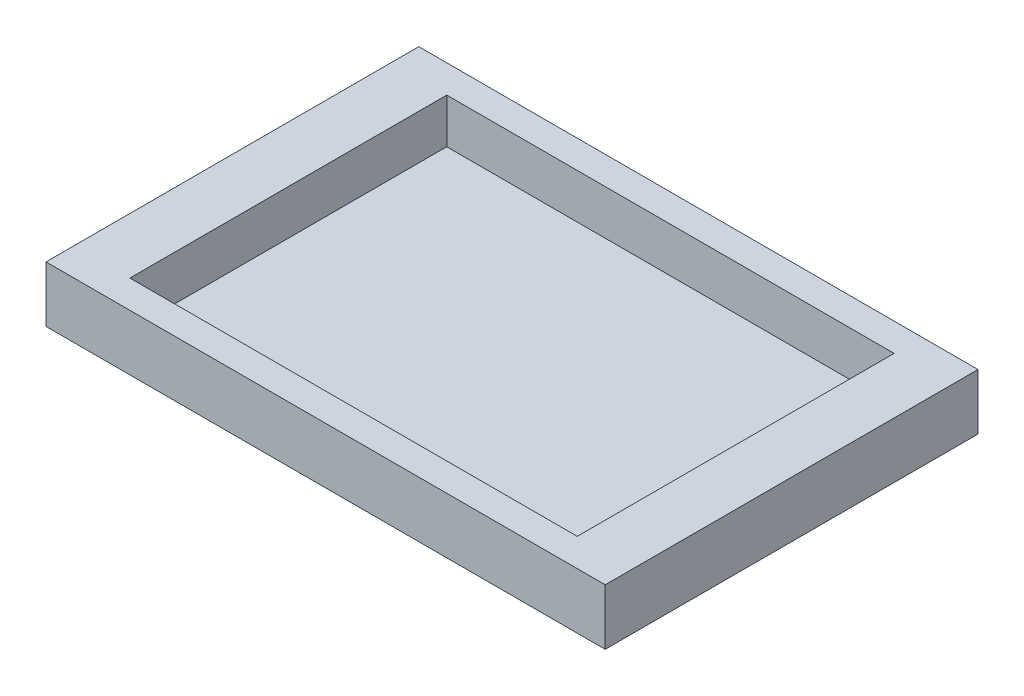
ISO-10303-21;
HEADER;
FILE_DESCRIPTION(('STEP AP214'),'2;1');
FILE_NAME('part.step','',(''),(''),'','','');
FILE_SCHEMA(('AUTOMOTIVE_DESIGN { 1 0 10303 214 1 1 1 1 }'));
ENDSEC;
DATA;
#1=APPLICATION_CONTEXT('core data for automotive mechanical design processes');
#2=APPLICATION_PROTOCOL_DEFINITION('international standard','automotive_design',2000,#1);
#3=PRODUCT_CONTEXT('',#1,'mechanical');
#4=PRODUCT('Part','Part','',(#3));
#5=PRODUCT_RELATED_PRODUCT_CATEGORY('part','',(#4));
#6=PRODUCT_DEFINITION_FORMATION('','',#4);
#7=PRODUCT_DEFINITION_CONTEXT('part definition',#1,'design');
#8=PRODUCT_DEFINITION('design','',#6,#7);
#9=PRODUCT_DEFINITION_SHAPE('','',#8);
#10=(LENGTH_UNIT() NAMED_UNIT(*) SI_UNIT(.MILLI.,.METRE.));
#11=(NAMED_UNIT(*) PLANE_ANGLE_UNIT() SI_UNIT($,.RADIAN.));
#12=(NAMED_UNIT(*) SI_UNIT($,.STERADIAN.) SOLID_ANGLE_UNIT());
#13=UNCERTAINTY_MEASURE_WITH_UNIT(LENGTH_MEASURE(1.E-05),#10,'distance_accuracy_value','');
#14=(GEOMETRIC_REPRESENTATION_CONTEXT(3) GLOBAL_UNCERTAINTY_ASSIGNED_CONTEXT((#13)) GLOBAL_UNIT_ASSIGNED_CONTEXT((#10,
#11,#12)) REPRESENTATION_CONTEXT('',''));
#15=CARTESIAN_POINT('',(0.,0.,0.));
#16=DIRECTION('',(0.,0.,1.));
#17=DIRECTION('',(1.,0.,0.));
#18=AXIS2_PLACEMENT_3D('',#15,#16,#17);
#19=CARTESIAN_POINT('',(75.,15.,-50.));
#20=DIRECTION('',(-1.,0.,0.));
#21=DIRECTION('',(0.,0.,1.));
#22=AXIS2_PLACEMENT_3D('',#19,#20,#21);
#23=PLANE('',#22);
#24=DIRECTION('',(0.,0.,-1.));
#25=VECTOR('',#24,1.);
#26=CARTESIAN_POINT('',(75.,0.,-50.));
#27=LINE('',#26,#25);
#28=CARTESIAN_POINT('',(75.,0.,50.));
#29=VERTEX_POINT('',#28);
#30=CARTESIAN_POINT('',(75.,0.,-50.));
#31=VERTEX_POINT('',#30);
#32=EDGE_CURVE('E143',#29,#31,#27,.T.);
#33=ORIENTED_EDGE('',*,*,#32,.T.);
#34=DIRECTION('',(0.,-1.,0.));
#35=VECTOR('',#34,1.);
#36=CARTESIAN_POINT('',(75.,15.,-50.));
#37=LINE('',#36,#35);
#38=CARTESIAN_POINT('',(75.,15.,-50.));
#39=VERTEX_POINT('',#38);
#40=EDGE_CURVE('E11',#39,#31,#37,.T.);
#41=ORIENTED_EDGE('',*,*,#40,.F.);
#42=DIRECTION('',(0.,0.,-1.));
#43=VECTOR('',#42,1.);
#44=CARTESIAN_POINT('',(75.,15.,-50.));
#45=LINE('',#44,#43);
#46=CARTESIAN_POINT('',(75.,15.,50.));
#47=VERTEX_POINT('',#46);
#48=EDGE_CURVE('E147',#47,#39,#45,.T.);
#49=ORIENTED_EDGE('',*,*,#48,.F.);
#50=DIRECTION('',(0.,-1.,0.));
#51=VECTOR('',#50,1.);
#52=CARTESIAN_POINT('',(75.,15.,50.));
#53=LINE('',#52,#51);
#54=EDGE_CURVE('E153',#47,#29,#53,.T.);
#55=ORIENTED_EDGE('',*,*,#54,.T.);
#56=EDGE_LOOP('',(#33,#41,#49,#55));
#57=FACE_BOUND('',#56,.T.);
#58=ADVANCED_FACE('F35',(#57),#23,.F.);
#59=CARTESIAN_POINT('',(-75.,15.,-50.));
#60=DIRECTION('',(0.,0.,1.));
#61=DIRECTION('',(1.,0.,0.));
#62=AXIS2_PLACEMENT_3D('',#59,#60,#61);
#63=PLANE('',#62);
#64=DIRECTION('',(-1.,0.,0.));
#65=VECTOR('',#64,1.);
#66=CARTESIAN_POINT('',(-75.,0.,-50.));
#67=LINE('',#66,#65);
#68=CARTESIAN_POINT('',(-75.,0.,-50.));
#69=VERTEX_POINT('',#68);
#70=EDGE_CURVE('E156',#31,#69,#67,.T.);
#71=ORIENTED_EDGE('',*,*,#70,.T.);
#72=DIRECTION('',(0.,-1.,0.));
#73=VECTOR('',#72,1.);
#74=CARTESIAN_POINT('',(-75.,15.,-50.));
#75=LINE('',#74,#73);
#76=CARTESIAN_POINT('',(-75.,15.,-50.));
#77=VERTEX_POINT('',#76);
#78=EDGE_CURVE('E42',#77,#69,#75,.T.);
#79=ORIENTED_EDGE('',*,*,#78,.F.);
#80=DIRECTION('',(-1.,0.,0.));
#81=VECTOR('',#80,1.);
#82=CARTESIAN_POINT('',(-75.,15.,-50.));
#83=LINE('',#82,#81);
#84=EDGE_CURVE('E86',#39,#77,#83,.T.);
#85=ORIENTED_EDGE('',*,*,#84,.F.);
#86=ORIENTED_EDGE('',*,*,#40,.T.);
#87=EDGE_LOOP('',(#71,#79,#85,#86));
#88=FACE_BOUND('',#87,.T.);
#89=ADVANCED_FACE('F185',(#88),#63,.F.);
#90=CARTESIAN_POINT('',(-75.,15.,-50.));
#91=DIRECTION('',(1.,0.,0.));
#92=DIRECTION('',(0.,0.,-1.));
#93=AXIS2_PLACEMENT_3D('',#90,#91,#92);
#94=PLANE('',#93);
#95=DIRECTION('',(0.,0.,1.));
#96=VECTOR('',#95,1.);
#97=CARTESIAN_POINT('',(-75.,0.,-50.));
#98=LINE('',#97,#96);
#99=CARTESIAN_POINT('',(-75.,0.,50.));
#100=VERTEX_POINT('',#99);
#101=EDGE_CURVE('E158',#69,#100,#98,.T.);
#102=ORIENTED_EDGE('',*,*,#101,.T.);
#103=DIRECTION('',(0.,-1.,0.));
#104=VECTOR('',#103,1.);
#105=CARTESIAN_POINT('',(-75.,15.,50.));
#106=LINE('',#105,#104);
#107=CARTESIAN_POINT('',(-75.,15.,50.));
#108=VERTEX_POINT('',#107);
#109=EDGE_CURVE('E162',#108,#100,#106,.T.);
#110=ORIENTED_EDGE('',*,*,#109,.F.);
#111=DIRECTION('',(0.,0.,1.));
#112=VECTOR('',#111,1.);
#113=CARTESIAN_POINT('',(-75.,15.,-50.));
#114=LINE('',#113,#112);
#115=EDGE_CURVE('E150',#77,#108,#114,.T.);
#116=ORIENTED_EDGE('',*,*,#115,.F.);
#117=ORIENTED_EDGE('',*,*,#78,.T.);
#118=EDGE_LOOP('',(#102,#110,#116,#117));
#119=FACE_BOUND('',#118,.T.);
#120=ADVANCED_FACE('F167',(#119),#94,.F.);
#121=CARTESIAN_POINT('',(-75.,15.,50.));
#122=DIRECTION('',(0.,0.,-1.));
#123=DIRECTION('',(-1.,0.,0.));
#124=AXIS2_PLACEMENT_3D('',#121,#122,#123);
#125=PLANE('',#124);
#126=DIRECTION('',(1.,0.,0.));
#127=VECTOR('',#126,1.);
#128=CARTESIAN_POINT('',(-75.,0.,50.));
#129=LINE('',#128,#127);
#130=EDGE_CURVE('E79',#100,#29,#129,.T.);
#131=ORIENTED_EDGE('',*,*,#130,.T.);
#132=ORIENTED_EDGE('',*,*,#54,.F.);
#133=DIRECTION('',(1.,0.,0.));
#134=VECTOR('',#133,1.);
#135=CARTESIAN_POINT('',(-75.,15.,50.));
#136=LINE('',#135,#134);
#137=EDGE_CURVE('E58',#108,#47,#136,.T.);
#138=ORIENTED_EDGE('',*,*,#137,.F.);
#139=ORIENTED_EDGE('',*,*,#109,.T.);
#140=EDGE_LOOP('',(#131,#132,#138,#139));
#141=FACE_BOUND('',#140,.T.);
#142=ADVANCED_FACE('F175',(#141),#125,.F.);
#143=CARTESIAN_POINT('',(0.,15.,0.));
#144=DIRECTION('',(0.,1.,0.));
#145=DIRECTION('',(0.,0.,1.));
#146=AXIS2_PLACEMENT_3D('',#143,#144,#145);
#147=PLANE('',#146);
#148=DIRECTION('',(0.,0.,1.));
#149=VECTOR('',#148,1.);
#150=CARTESIAN_POINT('',(-60.,15.,42.5));
#151=LINE('',#150,#149);
#152=CARTESIAN_POINT('',(-60.,15.,-42.5));
#153=VERTEX_POINT('',#152);
#154=CARTESIAN_POINT('',(-60.,15.,42.5));
#155=VERTEX_POINT('',#154);
#156=EDGE_CURVE('E49',#153,#155,#151,.T.);
#157=ORIENTED_EDGE('',*,*,#156,.F.);
#158=DIRECTION('',(-1.,0.,0.));
#159=VECTOR('',#158,1.);
#160=CARTESIAN_POINT('',(60.,15.,-42.5));
#161=LINE('',#160,#159);
#162=CARTESIAN_POINT('',(60.,15.,-42.5));
#163=VERTEX_POINT('',#162);
#164=EDGE_CURVE('E128',#163,#153,#161,.T.);
#165=ORIENTED_EDGE('',*,*,#164,.F.);
#166=DIRECTION('',(0.,0.,-1.));
#167=VECTOR('',#166,1.);
#168=CARTESIAN_POINT('',(60.,15.,42.5));
#169=LINE('',#168,#167);
#170=CARTESIAN_POINT('',(60.,15.,42.5));
#171=VERTEX_POINT('',#170);
#172=EDGE_CURVE('E131',#171,#163,#169,.T.);
#173=ORIENTED_EDGE('',*,*,#172,.F.);
#174=DIRECTION('',(1.,0.,0.));
#175=VECTOR('',#174,1.);
#176=CARTESIAN_POINT('',(60.,15.,42.5));
#177=LINE('',#176,#175);
#178=EDGE_CURVE('E137',#155,#171,#177,.T.);
#179=ORIENTED_EDGE('',*,*,#178,.F.);
#180=EDGE_LOOP('',(#157,#165,#173,#179));
#181=FACE_BOUND('',#180,.T.);
#182=ORIENTED_EDGE('',*,*,#48,.T.);
#183=ORIENTED_EDGE('',*,*,#84,.T.);
#184=ORIENTED_EDGE('',*,*,#115,.T.);
#185=ORIENTED_EDGE('',*,*,#137,.T.);
#186=EDGE_LOOP('',(#182,#183,#184,#185));
#187=FACE_BOUND('',#186,.T.);
#188=ADVANCED_FACE('F177',(#181,#187),#147,.T.);
#189=CARTESIAN_POINT('',(0.,0.,0.));
#190=DIRECTION('',(0.,1.,0.));
#191=DIRECTION('',(0.,0.,1.));
#192=AXIS2_PLACEMENT_3D('',#189,#190,#191);
#193=PLANE('',#192);
#194=ORIENTED_EDGE('',*,*,#32,.F.);
#195=ORIENTED_EDGE('',*,*,#130,.F.);
#196=ORIENTED_EDGE('',*,*,#101,.F.);
#197=ORIENTED_EDGE('',*,*,#70,.F.);
#198=EDGE_LOOP('',(#194,#195,#196,#197));
#199=FACE_BOUND('',#198,.T.);
#200=ADVANCED_FACE('F171',(#199),#193,.F.);
#201=CARTESIAN_POINT('',(-60.,3.,42.5));
#202=DIRECTION('',(-1.,0.,0.));
#203=DIRECTION('',(0.,0.,1.));
#204=AXIS2_PLACEMENT_3D('',#201,#202,#203);
#205=PLANE('',#204);
#206=ORIENTED_EDGE('',*,*,#156,.T.);
#207=DIRECTION('',(0.,1.,0.));
#208=VECTOR('',#207,1.);
#209=CARTESIAN_POINT('',(-60.,3.,42.5));
#210=LINE('',#209,#208);
#211=CARTESIAN_POINT('',(-60.,3.,42.5));
#212=VERTEX_POINT('',#211);
#213=EDGE_CURVE('E106',#212,#155,#210,.T.);
#214=ORIENTED_EDGE('',*,*,#213,.F.);
#215=DIRECTION('',(0.,0.,1.));
#216=VECTOR('',#215,1.);
#217=CARTESIAN_POINT('',(-60.,3.,42.5));
#218=LINE('',#217,#216);
#219=CARTESIAN_POINT('',(-60.,3.,-42.5));
#220=VERTEX_POINT('',#219);
#221=EDGE_CURVE('E110',#220,#212,#218,.T.);
#222=ORIENTED_EDGE('',*,*,#221,.F.);
#223=DIRECTION('',(0.,1.,0.));
#224=VECTOR('',#223,1.);
#225=CARTESIAN_POINT('',(-60.,3.,-42.5));
#226=LINE('',#225,#224);
#227=EDGE_CURVE('E141',#220,#153,#226,.T.);
#228=ORIENTED_EDGE('',*,*,#227,.T.);
#229=EDGE_LOOP('',(#206,#214,#222,#228));
#230=FACE_BOUND('',#229,.T.);
#231=ADVANCED_FACE('F108',(#230),#205,.F.);
#232=CARTESIAN_POINT('',(60.,3.,-42.5));
#233=DIRECTION('',(0.,0.,-1.));
#234=DIRECTION('',(-1.,0.,0.));
#235=AXIS2_PLACEMENT_3D('',#232,#233,#234);
#236=PLANE('',#235);
#237=ORIENTED_EDGE('',*,*,#164,.T.);
#238=ORIENTED_EDGE('',*,*,#227,.F.);
#239=DIRECTION('',(-1.,0.,0.));
#240=VECTOR('',#239,1.);
#241=CARTESIAN_POINT('',(60.,3.,-42.5));
#242=LINE('',#241,#240);
#243=CARTESIAN_POINT('',(60.,3.,-42.5));
#244=VERTEX_POINT('',#243);
#245=EDGE_CURVE('E116',#244,#220,#242,.T.);
#246=ORIENTED_EDGE('',*,*,#245,.F.);
#247=DIRECTION('',(0.,1.,0.));
#248=VECTOR('',#247,1.);
#249=CARTESIAN_POINT('',(60.,3.,-42.5));
#250=LINE('',#249,#248);
#251=EDGE_CURVE('E144',#244,#163,#250,.T.);
#252=ORIENTED_EDGE('',*,*,#251,.T.);
#253=EDGE_LOOP('',(#237,#238,#246,#252));
#254=FACE_BOUND('',#253,.T.);
#255=ADVANCED_FACE('F224',(#254),#236,.F.);
#256=CARTESIAN_POINT('',(60.,3.,42.5));
#257=DIRECTION('',(1.,0.,0.));
#258=DIRECTION('',(0.,0.,-1.));
#259=AXIS2_PLACEMENT_3D('',#256,#257,#258);
#260=PLANE('',#259);
#261=ORIENTED_EDGE('',*,*,#172,.T.);
#262=ORIENTED_EDGE('',*,*,#251,.F.);
#263=DIRECTION('',(0.,0.,-1.));
#264=VECTOR('',#263,1.);
#265=CARTESIAN_POINT('',(60.,3.,42.5));
#266=LINE('',#265,#264);
#267=CARTESIAN_POINT('',(60.,3.,42.5));
#268=VERTEX_POINT('',#267);
#269=EDGE_CURVE('E124',#268,#244,#266,.T.);
#270=ORIENTED_EDGE('',*,*,#269,.F.);
#271=DIRECTION('',(0.,1.,0.));
#272=VECTOR('',#271,1.);
#273=CARTESIAN_POINT('',(60.,3.,42.5));
#274=LINE('',#273,#272);
#275=EDGE_CURVE('E115',#268,#171,#274,.T.);
#276=ORIENTED_EDGE('',*,*,#275,.T.);
#277=EDGE_LOOP('',(#261,#262,#270,#276));
#278=FACE_BOUND('',#277,.T.);
#279=ADVANCED_FACE('F233',(#278),#260,.F.);
#280=CARTESIAN_POINT('',(60.,3.,42.5));
#281=DIRECTION('',(0.,0.,1.));
#282=DIRECTION('',(1.,0.,0.));
#283=AXIS2_PLACEMENT_3D('',#280,#281,#282);
#284=PLANE('',#283);
#285=ORIENTED_EDGE('',*,*,#178,.T.);
#286=ORIENTED_EDGE('',*,*,#275,.F.);
#287=DIRECTION('',(1.,0.,0.));
#288=VECTOR('',#287,1.);
#289=CARTESIAN_POINT('',(60.,3.,42.5));
#290=LINE('',#289,#288);
#291=EDGE_CURVE('E119',#212,#268,#290,.T.);
#292=ORIENTED_EDGE('',*,*,#291,.F.);
#293=ORIENTED_EDGE('',*,*,#213,.T.);
#294=EDGE_LOOP('',(#285,#286,#292,#293));
#295=FACE_BOUND('',#294,.T.);
#296=ADVANCED_FACE('F120',(#295),#284,.F.);
#297=CARTESIAN_POINT('',(0.,3.,0.));
#298=DIRECTION('',(0.,1.,0.));
#299=DIRECTION('',(0.,0.,1.));
#300=AXIS2_PLACEMENT_3D('',#297,#298,#299);
#301=PLANE('',#300);
#302=ORIENTED_EDGE('',*,*,#221,.T.);
#303=ORIENTED_EDGE('',*,*,#291,.T.);
#304=ORIENTED_EDGE('',*,*,#269,.T.);
#305=ORIENTED_EDGE('',*,*,#245,.T.);
#306=EDGE_LOOP('',(#302,#303,#304,#305));
#307=FACE_BOUND('',#306,.T.);
#308=ADVANCED_FACE('F126',(#307),#301,.T.);
#309=CLOSED_SHELL('',(#58,#89,#120,#142,#188,#200,#231,#255,#279,#296,#308));
#310=MANIFOLD_SOLID_BREP('B2',#309);
#311=ADVANCED_BREP_SHAPE_REPRESENTATION('',(#18,#310),#14);
#312=SHAPE_DEFINITION_REPRESENTATION(#9,#311);
ENDSEC;
END-ISO-10303-21;
